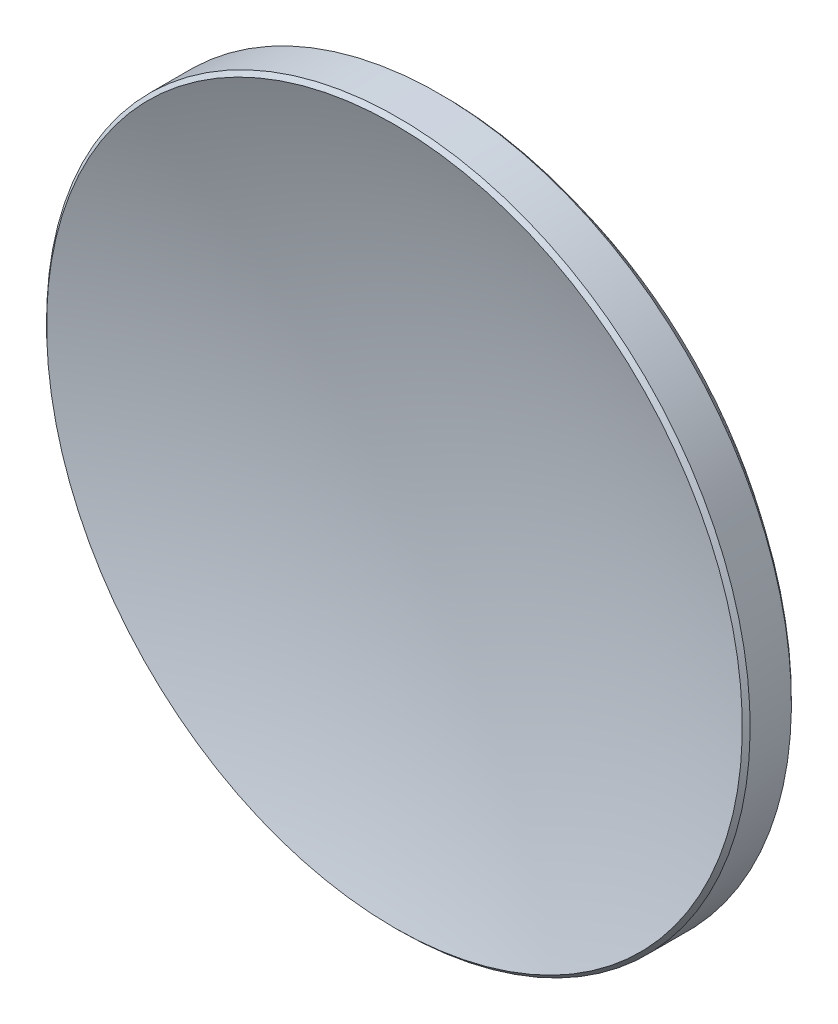
ISO-10303-21;
HEADER;
FILE_DESCRIPTION(('STEP AP214'),'2;1');
FILE_NAME('part.step','',(''),(''),'','','');
FILE_SCHEMA(('AUTOMOTIVE_DESIGN { 1 0 10303 214 1 1 1 1 }'));
ENDSEC;
DATA;
#1=APPLICATION_CONTEXT('core data for automotive mechanical design processes');
#2=APPLICATION_PROTOCOL_DEFINITION('international standard','automotive_design',2000,#1);
#3=PRODUCT_CONTEXT('',#1,'mechanical');
#4=PRODUCT('Part','Part','',(#3));
#5=PRODUCT_RELATED_PRODUCT_CATEGORY('part','',(#4));
#6=PRODUCT_DEFINITION_FORMATION('','',#4);
#7=PRODUCT_DEFINITION_CONTEXT('part definition',#1,'design');
#8=PRODUCT_DEFINITION('design','',#6,#7);
#9=PRODUCT_DEFINITION_SHAPE('','',#8);
#10=(LENGTH_UNIT() NAMED_UNIT(*) SI_UNIT(.MILLI.,.METRE.));
#11=(NAMED_UNIT(*) PLANE_ANGLE_UNIT() SI_UNIT($,.RADIAN.));
#12=(NAMED_UNIT(*) SI_UNIT($,.STERADIAN.) SOLID_ANGLE_UNIT());
#13=UNCERTAINTY_MEASURE_WITH_UNIT(LENGTH_MEASURE(1.E-05),#10,'distance_accuracy_value','');
#14=(GEOMETRIC_REPRESENTATION_CONTEXT(3) GLOBAL_UNCERTAINTY_ASSIGNED_CONTEXT((#13)) GLOBAL_UNIT_ASSIGNED_CONTEXT((#10,
#11,#12)) REPRESENTATION_CONTEXT('',''));
#15=CARTESIAN_POINT('',(0.,0.,0.));
#16=DIRECTION('',(0.,0.,1.));
#17=DIRECTION('',(1.,0.,0.));
#18=AXIS2_PLACEMENT_3D('',#15,#16,#17);
#19=CARTESIAN_POINT('',(0.,0.,37.6788486201362));
#20=DIRECTION('',(0.,0.,1.));
#21=DIRECTION('',(0.,1.,0.));
#22=AXIS2_PLACEMENT_3D('',#19,#20,#21);
#23=SPHERICAL_SURFACE('',#22,36.809);
#24=CARTESIAN_POINT('',(0.,0.,3.078493369815));
#25=DIRECTION('',(0.,0.,1.));
#26=DIRECTION('',(0.,-1.,0.));
#27=AXIS2_PLACEMENT_3D('',#24,#25,#26);
#28=CIRCLE('',#27,12.5585786437627);
#29=CARTESIAN_POINT('',(0.,-12.5585786437627,3.07849336981499));
#30=VERTEX_POINT('',#29);
#31=EDGE_CURVE('E27',#30,#30,#28,.T.);
#32=ORIENTED_EDGE('',*,*,#31,.T.);
#33=EDGE_LOOP('',(#32));
#34=FACE_BOUND('',#33,.T.);
#35=ADVANCED_FACE('F13',(#34),#23,.F.);
#36=CARTESIAN_POINT('',(0.,0.,16.8698486201362));
#37=DIRECTION('',(0.,0.,1.));
#38=DIRECTION('',(0.,-1.,0.));
#39=AXIS2_PLACEMENT_3D('',#36,#37,#38);
#40=SPHERICAL_SURFACE('',#39,20.);
#41=CARTESIAN_POINT('',(0.,0.,1.30443495880265));
#42=DIRECTION('',(0.,0.,1.));
#43=DIRECTION('',(0.,-1.,0.));
#44=AXIS2_PLACEMENT_3D('',#41,#42,#43);
#45=CIRCLE('',#44,12.5585786437627);
#46=CARTESIAN_POINT('',(0.,-12.5585786437627,1.30443495880265));
#47=VERTEX_POINT('',#46);
#48=EDGE_CURVE('E9',#47,#47,#45,.T.);
#49=ORIENTED_EDGE('',*,*,#48,.F.);
#50=EDGE_LOOP('',(#49));
#51=FACE_BOUND('',#50,.T.);
#52=ADVANCED_FACE('F48',(#51),#40,.T.);
#53=CARTESIAN_POINT('',(0.,0.,1.30443495880265));
#54=DIRECTION('',(0.,0.,1.));
#55=DIRECTION('',(0.,-1.,0.));
#56=AXIS2_PLACEMENT_3D('',#53,#54,#55);
#57=CONICAL_SURFACE('',#56,12.5585786437627,0.785398163397413);
#58=CARTESIAN_POINT('',(0.,0.,1.44585631503997));
#59=DIRECTION('',(0.,0.,1.));
#60=DIRECTION('',(0.,-1.,0.));
#61=AXIS2_PLACEMENT_3D('',#58,#59,#60);
#62=CIRCLE('',#61,12.7);
#63=CARTESIAN_POINT('',(0.,-12.7,1.44585631503997));
#64=VERTEX_POINT('',#63);
#65=EDGE_CURVE('E19',#64,#64,#62,.T.);
#66=ORIENTED_EDGE('',*,*,#65,.F.);
#67=EDGE_LOOP('',(#66));
#68=FACE_BOUND('',#67,.T.);
#69=ORIENTED_EDGE('',*,*,#48,.T.);
#70=EDGE_LOOP('',(#69));
#71=FACE_BOUND('',#70,.T.);
#72=ADVANCED_FACE('F42',(#68,#71),#57,.T.);
#73=CARTESIAN_POINT('',(0.,0.,0.86984862013616));
#74=DIRECTION('',(0.,0.,1.));
#75=DIRECTION('',(0.,-1.,0.));
#76=AXIS2_PLACEMENT_3D('',#73,#74,#75);
#77=CYLINDRICAL_SURFACE('',#76,12.7);
#78=CARTESIAN_POINT('',(0.,0.,2.93707201357769));
#79=DIRECTION('',(0.,0.,1.));
#80=DIRECTION('',(0.,-1.,0.));
#81=AXIS2_PLACEMENT_3D('',#78,#79,#80);
#82=CIRCLE('',#81,12.7);
#83=CARTESIAN_POINT('',(0.,-12.7,2.93707201357768));
#84=VERTEX_POINT('',#83);
#85=EDGE_CURVE('E23',#84,#84,#82,.T.);
#86=ORIENTED_EDGE('',*,*,#85,.F.);
#87=EDGE_LOOP('',(#86));
#88=FACE_BOUND('',#87,.T.);
#89=ORIENTED_EDGE('',*,*,#65,.T.);
#90=EDGE_LOOP('',(#89));
#91=FACE_BOUND('',#90,.T.);
#92=ADVANCED_FACE('F37',(#88,#91),#77,.T.);
#93=CARTESIAN_POINT('',(0.,0.,2.93707201357769));
#94=DIRECTION('',(0.,0.,-1.));
#95=DIRECTION('',(0.,1.,0.));
#96=AXIS2_PLACEMENT_3D('',#93,#94,#95);
#97=CONICAL_SURFACE('',#96,12.7,0.785398163397448);
#98=ORIENTED_EDGE('',*,*,#31,.F.);
#99=EDGE_LOOP('',(#98));
#100=FACE_BOUND('',#99,.T.);
#101=ORIENTED_EDGE('',*,*,#85,.T.);
#102=EDGE_LOOP('',(#101));
#103=FACE_BOUND('',#102,.T.);
#104=ADVANCED_FACE('F34',(#100,#103),#97,.T.);
#105=CLOSED_SHELL('',(#35,#52,#72,#92,#104));
#106=MANIFOLD_SOLID_BREP('B1',#105);
#107=ADVANCED_BREP_SHAPE_REPRESENTATION('',(#18,#106),#14);
#108=SHAPE_DEFINITION_REPRESENTATION(#9,#107);
ENDSEC;
END-ISO-10303-21;
